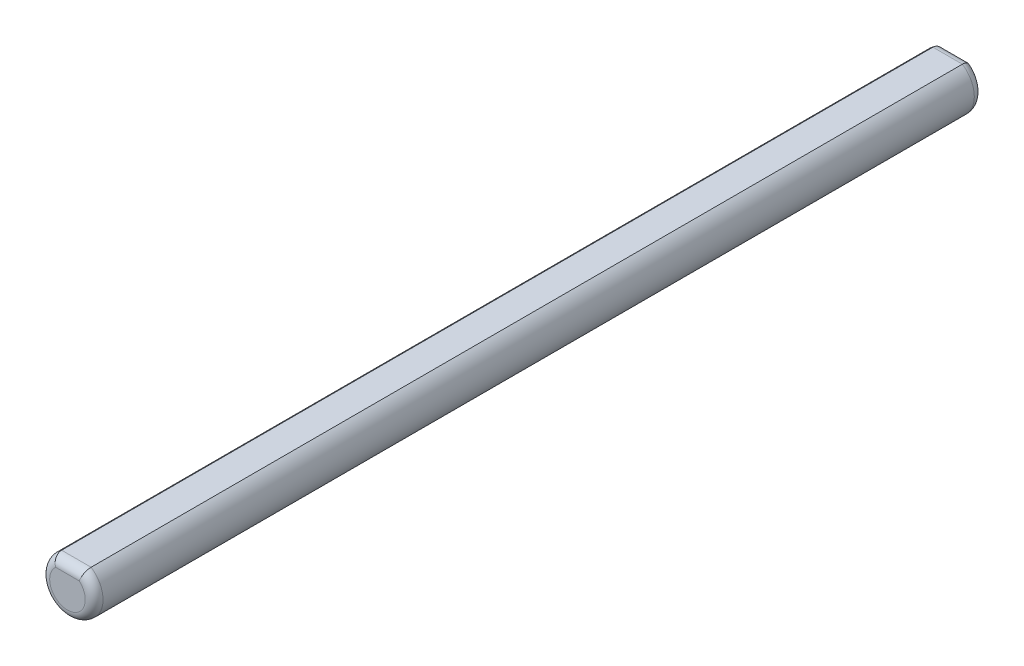
ISO-10303-21;
HEADER;
FILE_DESCRIPTION(('STEP AP214'),'2;1');
FILE_NAME('part.step','',(''),(''),'','','');
FILE_SCHEMA(('AUTOMOTIVE_DESIGN { 1 0 10303 214 1 1 1 1 }'));
ENDSEC;
DATA;
#1=APPLICATION_CONTEXT('core data for automotive mechanical design processes');
#2=APPLICATION_PROTOCOL_DEFINITION('international standard','automotive_design',2000,#1);
#3=PRODUCT_CONTEXT('',#1,'mechanical');
#4=PRODUCT('Part','Part','',(#3));
#5=PRODUCT_RELATED_PRODUCT_CATEGORY('part','',(#4));
#6=PRODUCT_DEFINITION_FORMATION('','',#4);
#7=PRODUCT_DEFINITION_CONTEXT('part definition',#1,'design');
#8=PRODUCT_DEFINITION('design','',#6,#7);
#9=PRODUCT_DEFINITION_SHAPE('','',#8);
#10=(LENGTH_UNIT() NAMED_UNIT(*) SI_UNIT(.MILLI.,.METRE.));
#11=(NAMED_UNIT(*) PLANE_ANGLE_UNIT() SI_UNIT($,.RADIAN.));
#12=(NAMED_UNIT(*) SI_UNIT($,.STERADIAN.) SOLID_ANGLE_UNIT());
#13=UNCERTAINTY_MEASURE_WITH_UNIT(LENGTH_MEASURE(1.E-05),#10,'distance_accuracy_value','');
#14=(GEOMETRIC_REPRESENTATION_CONTEXT(3) GLOBAL_UNCERTAINTY_ASSIGNED_CONTEXT((#13)) GLOBAL_UNIT_ASSIGNED_CONTEXT((#10,
#11,#12)) REPRESENTATION_CONTEXT('',''));
#15=CARTESIAN_POINT('',(0.,0.,0.));
#16=DIRECTION('',(0.,0.,1.));
#17=DIRECTION('',(1.,0.,0.));
#18=AXIS2_PLACEMENT_3D('',#15,#16,#17);
#19=CARTESIAN_POINT('',(41.9476914588956,41.8643434941887,15.1203737280403));
#20=DIRECTION('',(0.,0.,1.));
#21=DIRECTION('',(1.,0.,0.));
#22=AXIS2_PLACEMENT_3D('',#19,#20,#21);
#23=CYLINDRICAL_SURFACE('',#22,3.);
#24=DIRECTION('',(0.,0.,1.));
#25=VECTOR('',#24,1.);
#26=CARTESIAN_POINT('',(40.2893790637179,44.3643434941887,15.1203737280403));
#27=LINE('',#26,#25);
#28=CARTESIAN_POINT('',(40.2893790637179,44.3643434941887,16.1203737280403));
#29=VERTEX_POINT('',#28);
#30=CARTESIAN_POINT('',(40.2893790637179,44.3643434941887,114.12037372804));
#31=VERTEX_POINT('',#30);
#32=EDGE_CURVE('E89',#29,#31,#27,.T.);
#33=ORIENTED_EDGE('',*,*,#32,.F.);
#34=CARTESIAN_POINT('',(41.9476914588956,41.8643434941887,16.1203737280403));
#35=DIRECTION('',(0.,0.,1.));
#36=DIRECTION('',(1.,0.,0.));
#37=AXIS2_PLACEMENT_3D('',#34,#35,#36);
#38=CIRCLE('',#37,3.);
#39=CARTESIAN_POINT('',(43.6060038540733,44.3643434941887,16.1203737280403));
#40=VERTEX_POINT('',#39);
#41=EDGE_CURVE('E101',#29,#40,#38,.T.);
#42=ORIENTED_EDGE('',*,*,#41,.T.);
#43=DIRECTION('',(0.,0.,1.));
#44=VECTOR('',#43,1.);
#45=CARTESIAN_POINT('',(43.6060038540733,44.3643434941887,15.1203737280403));
#46=LINE('',#45,#44);
#47=CARTESIAN_POINT('',(43.6060038540733,44.3643434941887,114.12037372804));
#48=VERTEX_POINT('',#47);
#49=EDGE_CURVE('E91',#40,#48,#46,.T.);
#50=ORIENTED_EDGE('',*,*,#49,.T.);
#51=CARTESIAN_POINT('',(41.9476914588956,41.8643434941887,114.12037372804));
#52=DIRECTION('',(0.,0.,1.));
#53=DIRECTION('',(1.,0.,0.));
#54=AXIS2_PLACEMENT_3D('',#51,#52,#53);
#55=CIRCLE('',#54,3.);
#56=EDGE_CURVE('E102',#48,#31,#55,.F.);
#57=ORIENTED_EDGE('',*,*,#56,.T.);
#58=EDGE_LOOP('',(#33,#42,#50,#57));
#59=FACE_BOUND('',#58,.T.);
#60=ADVANCED_FACE('F37',(#59),#23,.T.);
#61=CARTESIAN_POINT('',(43.6060038540733,44.3643434941887,15.1203737280403));
#62=DIRECTION('',(0.,1.,0.));
#63=DIRECTION('',(0.,0.,1.));
#64=AXIS2_PLACEMENT_3D('',#61,#62,#63);
#65=PLANE('',#64);
#66=ORIENTED_EDGE('',*,*,#49,.F.);
#67=DIRECTION('',(-1.,0.,0.));
#68=VECTOR('',#67,1.);
#69=CARTESIAN_POINT('',(40.2893790637179,44.3643434941887,16.1203737280403));
#70=LINE('',#69,#68);
#71=EDGE_CURVE('E86',#40,#29,#70,.T.);
#72=ORIENTED_EDGE('',*,*,#71,.T.);
#73=ORIENTED_EDGE('',*,*,#32,.T.);
#74=DIRECTION('',(-1.,0.,0.));
#75=VECTOR('',#74,1.);
#76=CARTESIAN_POINT('',(43.6060038540733,44.3643434941887,114.12037372804));
#77=LINE('',#76,#75);
#78=EDGE_CURVE('E96',#31,#48,#77,.F.);
#79=ORIENTED_EDGE('',*,*,#78,.T.);
#80=EDGE_LOOP('',(#66,#72,#73,#79));
#81=FACE_BOUND('',#80,.T.);
#82=ADVANCED_FACE('F88',(#81),#65,.T.);
#83=CARTESIAN_POINT('',(41.9476914588956,41.8643434941887,15.1203737280403));
#84=DIRECTION('',(0.,0.,1.));
#85=DIRECTION('',(1.,0.,0.));
#86=AXIS2_PLACEMENT_3D('',#83,#84,#85);
#87=PLANE('',#86);
#88=DIRECTION('',(-1.,0.,0.));
#89=VECTOR('',#88,1.);
#90=CARTESIAN_POINT('',(43.6060038540733,43.3643434941887,15.1203737280403));
#91=LINE('',#90,#89);
#92=CARTESIAN_POINT('',(40.6248158033633,43.3643434941887,15.1203737280403));
#93=VERTEX_POINT('',#92);
#94=CARTESIAN_POINT('',(43.2705671144279,43.3643434941887,15.1203737280403));
#95=VERTEX_POINT('',#94);
#96=EDGE_CURVE('E107',#93,#95,#91,.F.);
#97=ORIENTED_EDGE('',*,*,#96,.T.);
#98=CARTESIAN_POINT('',(41.9476914588956,41.8643434941887,15.1203737280403));
#99=DIRECTION('',(0.,0.,1.));
#100=DIRECTION('',(1.,0.,0.));
#101=AXIS2_PLACEMENT_3D('',#98,#99,#100);
#102=CIRCLE('',#101,2.);
#103=EDGE_CURVE('E115',#95,#93,#102,.F.);
#104=ORIENTED_EDGE('',*,*,#103,.T.);
#105=EDGE_LOOP('',(#97,#104));
#106=FACE_BOUND('',#105,.T.);
#107=ADVANCED_FACE('F150',(#106),#87,.F.);
#108=CARTESIAN_POINT('',(41.9476914588956,41.8643434941887,115.12037372804));
#109=DIRECTION('',(0.,0.,1.));
#110=DIRECTION('',(1.,0.,0.));
#111=AXIS2_PLACEMENT_3D('',#108,#109,#110);
#112=PLANE('',#111);
#113=DIRECTION('',(-1.,0.,0.));
#114=VECTOR('',#113,1.);
#115=CARTESIAN_POINT('',(41.9476914588956,43.3643434941887,115.12037372804));
#116=LINE('',#115,#114);
#117=CARTESIAN_POINT('',(43.2705671144279,43.3643434941887,115.12037372804));
#118=VERTEX_POINT('',#117);
#119=CARTESIAN_POINT('',(40.6248158033633,43.3643434941887,115.12037372804));
#120=VERTEX_POINT('',#119);
#121=EDGE_CURVE('E51',#118,#120,#116,.T.);
#122=ORIENTED_EDGE('',*,*,#121,.T.);
#123=CARTESIAN_POINT('',(41.9476914588956,41.8643434941887,115.12037372804));
#124=DIRECTION('',(0.,0.,1.));
#125=DIRECTION('',(1.,0.,0.));
#126=AXIS2_PLACEMENT_3D('',#123,#124,#125);
#127=CIRCLE('',#126,2.);
#128=EDGE_CURVE('E11',#120,#118,#127,.T.);
#129=ORIENTED_EDGE('',*,*,#128,.T.);
#130=EDGE_LOOP('',(#122,#129));
#131=FACE_BOUND('',#130,.T.);
#132=ADVANCED_FACE('F148',(#131),#112,.T.);
#133=CARTESIAN_POINT('',(43.6060038540733,43.3643434941887,16.1203737280403));
#134=DIRECTION('',(1.,0.,0.));
#135=DIRECTION('',(0.,0.,-1.));
#136=AXIS2_PLACEMENT_3D('',#133,#134,#135);
#137=CYLINDRICAL_SURFACE('',#136,1.);
#138=CARTESIAN_POINT('',(43.6060038540733,44.3643434941887,16.1203737280403));
#139=CARTESIAN_POINT('',(43.6060036499257,44.3643439035082,16.0931521456357));
#140=CARTESIAN_POINT('',(43.6056685286001,44.3632312197964,16.0659438723762));
#141=CARTESIAN_POINT('',(43.6043306523791,44.3587962545152,16.0117278129323));
#142=CARTESIAN_POINT('',(43.6033279778233,44.3554742388376,15.9847200030179));
#143=CARTESIAN_POINT('',(43.5993288126425,44.3422418578523,15.9043889524927));
#144=CARTESIAN_POINT('',(43.595341147593,44.3290649578501,15.8516134408123));
#145=CARTESIAN_POINT('',(43.5848058378447,44.2944595206135,15.7491411345772));
#146=CARTESIAN_POINT('',(43.5782578776737,44.273029966516,15.6994447202945));
#147=CARTESIAN_POINT('',(43.5627361929149,44.222652893557,15.6044326330933));
#148=CARTESIAN_POINT('',(43.5537623127816,44.1937048926316,15.5591172413308));
#149=CARTESIAN_POINT('',(43.5334047957012,44.1287252461661,15.4733324399498));
#150=CARTESIAN_POINT('',(43.5219851449774,44.092588383801,15.4329514409634));
#151=CARTESIAN_POINT('',(43.497041719688,44.0146743580435,15.3588208971244));
#152=CARTESIAN_POINT('',(43.4835173320053,43.972895551604,15.3250732911049));
#153=CARTESIAN_POINT('',(43.4540333056873,43.8831834943513,15.2637081474925));
#154=CARTESIAN_POINT('',(43.4379979426221,43.8350710086787,15.2363895049785));
#155=CARTESIAN_POINT('',(43.4042129667011,43.735513585605,15.1901891548993));
#156=CARTESIAN_POINT('',(43.3864632898518,43.684068523826,15.1713077624358));
#157=CARTESIAN_POINT('',(43.3530240471078,43.5890776458156,15.1449487845523));
#158=CARTESIAN_POINT('',(43.3375674092771,43.5458474137038,15.1360013511915));
#159=CARTESIAN_POINT('',(43.3059303981222,43.4589072964839,15.1238910799615));
#160=CARTESIAN_POINT('',(43.2897514088675,43.4151984403518,15.1207176282413));
#161=CARTESIAN_POINT('',(43.2723991885997,43.3691932139098,15.1203825254198));
#162=CARTESIAN_POINT('',(43.2714835416486,43.3667681188916,15.1203737049995));
#163=CARTESIAN_POINT('',(43.2705671144279,43.3643434941887,15.1203737280403));
#164=B_SPLINE_CURVE_WITH_KNOTS('',3,(#138,#139,#140,#141,#142,#143,#144,#145,#146,#147,#148,
#149,#150,#151,#152,#153,#154,#155,#156,#157,#158,#159,#160,#161,#162,#163),.UNSPECIFIED.,.F.,
.F.,(4,2,2,2,2,2,2,2,2,2,2,2,4),(0.,0.0816136602064479,0.163217500040097,0.325996852716947,
0.488796268916036,0.651606125984404,0.81700215616083,0.982446457262254,1.15450283687374,
1.32656564165139,1.4665475991401,1.60627197795951,1.61404854681601),.UNSPECIFIED.);
#165=EDGE_CURVE('E111',#95,#40,#164,.F.);
#166=ORIENTED_EDGE('',*,*,#165,.F.);
#167=ORIENTED_EDGE('',*,*,#96,.F.);
#168=CARTESIAN_POINT('',(40.2893790637179,44.3643434941887,16.1203737280403));
#169=CARTESIAN_POINT('',(40.2893792678655,44.3643439035082,16.0931521456357));
#170=CARTESIAN_POINT('',(40.2897143891911,44.3632312197964,16.0659438723762));
#171=CARTESIAN_POINT('',(40.2910522654121,44.3587962545152,16.0117278129323));
#172=CARTESIAN_POINT('',(40.2920549399679,44.3554742388376,15.9847200030179));
#173=CARTESIAN_POINT('',(40.2960541051487,44.3422418578523,15.9043889524927));
#174=CARTESIAN_POINT('',(40.3000417701982,44.3290649578501,15.8516134408123));
#175=CARTESIAN_POINT('',(40.3105770799465,44.2944595206135,15.7491411345772));
#176=CARTESIAN_POINT('',(40.3171250401175,44.273029966516,15.6994447202945));
#177=CARTESIAN_POINT('',(40.3326467248763,44.222652893557,15.6044326330933));
#178=CARTESIAN_POINT('',(40.3416206050096,44.1937048926316,15.5591172413308));
#179=CARTESIAN_POINT('',(40.36197812209,44.1287252461661,15.4733324399498));
#180=CARTESIAN_POINT('',(40.3733977728138,44.092588383801,15.4329514409634));
#181=CARTESIAN_POINT('',(40.3983411981032,44.0146743580435,15.3588208971244));
#182=CARTESIAN_POINT('',(40.4118655857859,43.972895551604,15.3250732911049));
#183=CARTESIAN_POINT('',(40.4413496121039,43.8831834943513,15.2637081474925));
#184=CARTESIAN_POINT('',(40.4573849751691,43.8350710086787,15.2363895049785));
#185=CARTESIAN_POINT('',(40.4911699510901,43.735513585605,15.1901891548993));
#186=CARTESIAN_POINT('',(40.5089196279394,43.684068523826,15.1713077624358));
#187=CARTESIAN_POINT('',(40.5423588706834,43.5890776458156,15.1449487845523));
#188=CARTESIAN_POINT('',(40.5578155085141,43.5458474137038,15.1360013511915));
#189=CARTESIAN_POINT('',(40.589452519669,43.4589072964839,15.1238910799615));
#190=CARTESIAN_POINT('',(40.6056315089237,43.4151984403518,15.1207176282413));
#191=CARTESIAN_POINT('',(40.6229837291915,43.3691932139098,15.1203825254198));
#192=CARTESIAN_POINT('',(40.6238993761426,43.3667681188916,15.1203737049995));
#193=CARTESIAN_POINT('',(40.6248158033633,43.3643434941887,15.1203737280403));
#194=B_SPLINE_CURVE_WITH_KNOTS('',3,(#168,#169,#170,#171,#172,#173,#174,#175,#176,#177,#178,
#179,#180,#181,#182,#183,#184,#185,#186,#187,#188,#189,#190,#191,#192,#193),.UNSPECIFIED.,.F.,
.F.,(4,2,2,2,2,2,2,2,2,2,2,2,4),(0.,0.0816136602064479,0.163217500040097,0.325996852716947,
0.488796268916036,0.651606125984404,0.817002156160833,0.982446457262254,1.15450283687374,
1.32656564165139,1.4665475991401,1.60627197795951,1.61404854681601),.UNSPECIFIED.);
#195=EDGE_CURVE('E105',#29,#93,#194,.T.);
#196=ORIENTED_EDGE('',*,*,#195,.F.);
#197=ORIENTED_EDGE('',*,*,#71,.F.);
#198=EDGE_LOOP('',(#166,#167,#196,#197));
#199=FACE_BOUND('',#198,.T.);
#200=ADVANCED_FACE('F106',(#199),#137,.T.);
#201=CARTESIAN_POINT('',(41.9476914588956,41.8643434941887,16.1203737280403));
#202=DIRECTION('',(0.,0.,1.));
#203=DIRECTION('',(1.,0.,0.));
#204=AXIS2_PLACEMENT_3D('',#201,#202,#203);
#205=TOROIDAL_SURFACE('',#204,2.,1.);
#206=ORIENTED_EDGE('',*,*,#195,.T.);
#207=ORIENTED_EDGE('',*,*,#103,.F.);
#208=ORIENTED_EDGE('',*,*,#165,.T.);
#209=ORIENTED_EDGE('',*,*,#41,.F.);
#210=EDGE_LOOP('',(#206,#207,#208,#209));
#211=FACE_BOUND('',#210,.T.);
#212=ADVANCED_FACE('F113',(#211),#205,.T.);
#213=CARTESIAN_POINT('',(41.9476914588956,43.3643434941887,114.12037372804));
#214=DIRECTION('',(-1.,0.,0.));
#215=DIRECTION('',(0.,0.,1.));
#216=AXIS2_PLACEMENT_3D('',#213,#214,#215);
#217=CYLINDRICAL_SURFACE('',#216,1.);
#218=CARTESIAN_POINT('',(43.6060038540733,44.3643434941887,114.12037372804));
#219=CARTESIAN_POINT('',(43.6060036499257,44.3643439035082,114.147595310445));
#220=CARTESIAN_POINT('',(43.6056685286001,44.3632312197964,114.174803583704));
#221=CARTESIAN_POINT('',(43.6043306523791,44.3587962545152,114.229019643148));
#222=CARTESIAN_POINT('',(43.6033279778233,44.3554742388376,114.256027453063));
#223=CARTESIAN_POINT('',(43.5993288126425,44.3422418578523,114.336358503588));
#224=CARTESIAN_POINT('',(43.595341147593,44.3290649578501,114.389134015268));
#225=CARTESIAN_POINT('',(43.5848058378447,44.2944595206135,114.491606321503));
#226=CARTESIAN_POINT('',(43.5782578776737,44.273029966516,114.541302735786));
#227=CARTESIAN_POINT('',(43.5627361929149,44.222652893557,114.636314822987));
#228=CARTESIAN_POINT('',(43.5537623127816,44.1937048926316,114.68163021475));
#229=CARTESIAN_POINT('',(43.5334047957012,44.1287252461661,114.767415016131));
#230=CARTESIAN_POINT('',(43.5219851449774,44.092588383801,114.807796015117));
#231=CARTESIAN_POINT('',(43.497041719688,44.0146743580435,114.881926558956));
#232=CARTESIAN_POINT('',(43.4835173320053,43.972895551604,114.915674164976));
#233=CARTESIAN_POINT('',(43.4540333056873,43.8831834943513,114.977039308588));
#234=CARTESIAN_POINT('',(43.4379979426221,43.8350710086787,115.004357951102));
#235=CARTESIAN_POINT('',(43.4042129667011,43.735513585605,115.050558301181));
#236=CARTESIAN_POINT('',(43.3864632898518,43.684068523826,115.069439693645));
#237=CARTESIAN_POINT('',(43.3530240471078,43.5890776458156,115.095798671528));
#238=CARTESIAN_POINT('',(43.3375674092771,43.5458474137038,115.104746104889));
#239=CARTESIAN_POINT('',(43.3059303981222,43.4589072964839,115.116856376119));
#240=CARTESIAN_POINT('',(43.2897514088676,43.4151984403518,115.120029827839));
#241=CARTESIAN_POINT('',(43.2723991885997,43.3691932139098,115.120364930661));
#242=CARTESIAN_POINT('',(43.2714835416486,43.3667681188916,115.120373751081));
#243=CARTESIAN_POINT('',(43.2705671144279,43.3643434941887,115.12037372804));
#244=B_SPLINE_CURVE_WITH_KNOTS('',3,(#218,#219,#220,#221,#222,#223,#224,#225,#226,#227,#228,
#229,#230,#231,#232,#233,#234,#235,#236,#237,#238,#239,#240,#241,#242,#243),.UNSPECIFIED.,.F.,
.F.,(4,2,2,2,2,2,2,2,2,2,2,2,4),(0.,0.0816136602064652,0.163217500040111,0.325996852716947,
0.48879626891604,0.651606125984406,0.81700215616084,0.982446457262256,1.15450283687374,
1.32656564165139,1.4665475991401,1.6062719779595,1.61404854681601),.UNSPECIFIED.);
#245=EDGE_CURVE('E64',#48,#118,#244,.T.);
#246=ORIENTED_EDGE('',*,*,#245,.F.);
#247=ORIENTED_EDGE('',*,*,#78,.F.);
#248=CARTESIAN_POINT('',(40.2893790637179,44.3643434941887,114.12037372804));
#249=CARTESIAN_POINT('',(40.2893792678655,44.3643439035082,114.147595310445));
#250=CARTESIAN_POINT('',(40.2897143891911,44.3632312197964,114.174803583704));
#251=CARTESIAN_POINT('',(40.2910522654121,44.3587962545152,114.229019643148));
#252=CARTESIAN_POINT('',(40.2920549399679,44.3554742388376,114.256027453063));
#253=CARTESIAN_POINT('',(40.2960541051487,44.3422418578523,114.336358503588));
#254=CARTESIAN_POINT('',(40.3000417701982,44.3290649578501,114.389134015268));
#255=CARTESIAN_POINT('',(40.3105770799465,44.2944595206135,114.491606321503));
#256=CARTESIAN_POINT('',(40.3171250401175,44.273029966516,114.541302735786));
#257=CARTESIAN_POINT('',(40.3326467248763,44.222652893557,114.636314822987));
#258=CARTESIAN_POINT('',(40.3416206050096,44.1937048926316,114.68163021475));
#259=CARTESIAN_POINT('',(40.36197812209,44.1287252461661,114.767415016131));
#260=CARTESIAN_POINT('',(40.3733977728138,44.092588383801,114.807796015117));
#261=CARTESIAN_POINT('',(40.3983411981032,44.0146743580435,114.881926558956));
#262=CARTESIAN_POINT('',(40.4118655857859,43.972895551604,114.915674164976));
#263=CARTESIAN_POINT('',(40.4413496121039,43.8831834943513,114.977039308588));
#264=CARTESIAN_POINT('',(40.4573849751691,43.8350710086787,115.004357951102));
#265=CARTESIAN_POINT('',(40.4911699510901,43.735513585605,115.050558301181));
#266=CARTESIAN_POINT('',(40.5089196279394,43.684068523826,115.069439693645));
#267=CARTESIAN_POINT('',(40.5423588706834,43.5890776458156,115.095798671528));
#268=CARTESIAN_POINT('',(40.5578155085141,43.5458474137038,115.104746104889));
#269=CARTESIAN_POINT('',(40.589452519669,43.4589072964839,115.116856376119));
#270=CARTESIAN_POINT('',(40.6056315089236,43.4151984403518,115.120029827839));
#271=CARTESIAN_POINT('',(40.6229837291915,43.3691932139098,115.120364930661));
#272=CARTESIAN_POINT('',(40.6238993761426,43.3667681188916,115.120373751081));
#273=CARTESIAN_POINT('',(40.6248158033633,43.3643434941887,115.12037372804));
#274=B_SPLINE_CURVE_WITH_KNOTS('',3,(#248,#249,#250,#251,#252,#253,#254,#255,#256,#257,#258,
#259,#260,#261,#262,#263,#264,#265,#266,#267,#268,#269,#270,#271,#272,#273),.UNSPECIFIED.,.F.,
.F.,(4,2,2,2,2,2,2,2,2,2,2,2,4),(0.,0.0816136602064652,0.163217500040111,0.325996852716947,
0.48879626891604,0.651606125984406,0.81700215616084,0.982446457262256,1.15450283687374,
1.32656564165139,1.4665475991401,1.6062719779595,1.61404854681601),.UNSPECIFIED.);
#275=EDGE_CURVE('E42',#120,#31,#274,.F.);
#276=ORIENTED_EDGE('',*,*,#275,.F.);
#277=ORIENTED_EDGE('',*,*,#121,.F.);
#278=EDGE_LOOP('',(#246,#247,#276,#277));
#279=FACE_BOUND('',#278,.T.);
#280=ADVANCED_FACE('F39',(#279),#217,.T.);
#281=CARTESIAN_POINT('',(41.9476914588956,41.8643434941887,114.12037372804));
#282=DIRECTION('',(0.,0.,1.));
#283=DIRECTION('',(1.,0.,0.));
#284=AXIS2_PLACEMENT_3D('',#281,#282,#283);
#285=TOROIDAL_SURFACE('',#284,2.,1.);
#286=ORIENTED_EDGE('',*,*,#275,.T.);
#287=ORIENTED_EDGE('',*,*,#56,.F.);
#288=ORIENTED_EDGE('',*,*,#245,.T.);
#289=ORIENTED_EDGE('',*,*,#128,.F.);
#290=EDGE_LOOP('',(#286,#287,#288,#289));
#291=FACE_BOUND('',#290,.T.);
#292=ADVANCED_FACE('F137',(#291),#285,.T.);
#293=CLOSED_SHELL('',(#60,#82,#107,#132,#200,#212,#280,#292));
#294=MANIFOLD_SOLID_BREP('B2',#293);
#295=ADVANCED_BREP_SHAPE_REPRESENTATION('',(#18,#294),#14);
#296=SHAPE_DEFINITION_REPRESENTATION(#9,#295);
ENDSEC;
END-ISO-10303-21;
